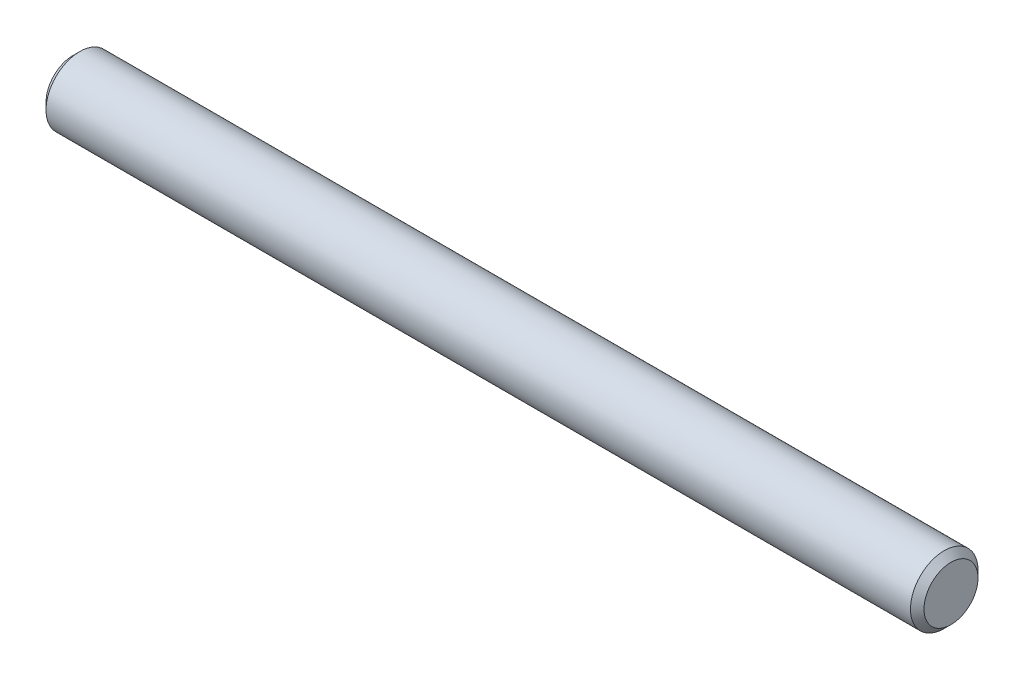
ISO-10303-21;
HEADER;
FILE_DESCRIPTION(('STEP AP214'),'2;1');
FILE_NAME('part.step','',(''),(''),'','','');
FILE_SCHEMA(('AUTOMOTIVE_DESIGN { 1 0 10303 214 1 1 1 1 }'));
ENDSEC;
DATA;
#1=APPLICATION_CONTEXT('core data for automotive mechanical design processes');
#2=APPLICATION_PROTOCOL_DEFINITION('international standard','automotive_design',2000,#1);
#3=PRODUCT_CONTEXT('',#1,'mechanical');
#4=PRODUCT('Part','Part','',(#3));
#5=PRODUCT_RELATED_PRODUCT_CATEGORY('part','',(#4));
#6=PRODUCT_DEFINITION_FORMATION('','',#4);
#7=PRODUCT_DEFINITION_CONTEXT('part definition',#1,'design');
#8=PRODUCT_DEFINITION('design','',#6,#7);
#9=PRODUCT_DEFINITION_SHAPE('','',#8);
#10=(LENGTH_UNIT() NAMED_UNIT(*) SI_UNIT(.MILLI.,.METRE.));
#11=(NAMED_UNIT(*) PLANE_ANGLE_UNIT() SI_UNIT($,.RADIAN.));
#12=(NAMED_UNIT(*) SI_UNIT($,.STERADIAN.) SOLID_ANGLE_UNIT());
#13=UNCERTAINTY_MEASURE_WITH_UNIT(LENGTH_MEASURE(1.E-05),#10,'distance_accuracy_value','');
#14=(GEOMETRIC_REPRESENTATION_CONTEXT(3) GLOBAL_UNCERTAINTY_ASSIGNED_CONTEXT((#13)) GLOBAL_UNIT_ASSIGNED_CONTEXT((#10,
#11,#12)) REPRESENTATION_CONTEXT('',''));
#15=CARTESIAN_POINT('',(0.,0.,0.));
#16=DIRECTION('',(0.,0.,1.));
#17=DIRECTION('',(1.,0.,0.));
#18=AXIS2_PLACEMENT_3D('',#15,#16,#17);
#19=CARTESIAN_POINT('',(-20.6375,0.,0.));
#20=DIRECTION('',(1.,0.,0.));
#21=DIRECTION('',(0.,0.,-1.));
#22=AXIS2_PLACEMENT_3D('',#19,#20,#21);
#23=CYLINDRICAL_SURFACE('',#22,1.5875);
#24=CARTESIAN_POINT('',(20.32,0.,0.));
#25=DIRECTION('',(1.,0.,0.));
#26=DIRECTION('',(0.,0.,-1.));
#27=AXIS2_PLACEMENT_3D('',#24,#25,#26);
#28=CIRCLE('',#27,1.5875);
#29=CARTESIAN_POINT('',(20.32,0.,-1.5875));
#30=VERTEX_POINT('',#29);
#31=EDGE_CURVE('E37',#30,#30,#28,.F.);
#32=ORIENTED_EDGE('',*,*,#31,.T.);
#33=EDGE_LOOP('',(#32));
#34=FACE_BOUND('',#33,.T.);
#35=CARTESIAN_POINT('',(-20.32,0.,0.));
#36=DIRECTION('',(1.,0.,0.));
#37=DIRECTION('',(0.,0.,-1.));
#38=AXIS2_PLACEMENT_3D('',#35,#36,#37);
#39=CIRCLE('',#38,1.5875);
#40=CARTESIAN_POINT('',(-20.32,0.,-1.5875));
#41=VERTEX_POINT('',#40);
#42=EDGE_CURVE('E41',#41,#41,#39,.T.);
#43=ORIENTED_EDGE('',*,*,#42,.T.);
#44=EDGE_LOOP('',(#43));
#45=FACE_BOUND('',#44,.T.);
#46=ADVANCED_FACE('F30',(#34,#45),#23,.T.);
#47=CARTESIAN_POINT('',(-20.6375,0.,0.));
#48=DIRECTION('',(1.,0.,0.));
#49=DIRECTION('',(0.,0.,-1.));
#50=AXIS2_PLACEMENT_3D('',#47,#48,#49);
#51=PLANE('',#50);
#52=CARTESIAN_POINT('',(-20.6375,0.,0.));
#53=DIRECTION('',(1.,0.,0.));
#54=DIRECTION('',(0.,0.,-1.));
#55=AXIS2_PLACEMENT_3D('',#52,#53,#54);
#56=CIRCLE('',#55,1.27);
#57=CARTESIAN_POINT('',(-20.6375,0.,-1.27));
#58=VERTEX_POINT('',#57);
#59=EDGE_CURVE('E10',#58,#58,#56,.F.);
#60=ORIENTED_EDGE('',*,*,#59,.T.);
#61=EDGE_LOOP('',(#60));
#62=FACE_BOUND('',#61,.T.);
#63=ADVANCED_FACE('F61',(#62),#51,.F.);
#64=CARTESIAN_POINT('',(20.6375,0.,0.));
#65=DIRECTION('',(1.,0.,0.));
#66=DIRECTION('',(0.,0.,-1.));
#67=AXIS2_PLACEMENT_3D('',#64,#65,#66);
#68=PLANE('',#67);
#69=CARTESIAN_POINT('',(20.6375,0.,0.));
#70=DIRECTION('',(1.,0.,0.));
#71=DIRECTION('',(0.,0.,-1.));
#72=AXIS2_PLACEMENT_3D('',#69,#70,#71);
#73=CIRCLE('',#72,1.27);
#74=CARTESIAN_POINT('',(20.6375,0.,-1.27));
#75=VERTEX_POINT('',#74);
#76=EDGE_CURVE('E45',#75,#75,#73,.T.);
#77=ORIENTED_EDGE('',*,*,#76,.T.);
#78=EDGE_LOOP('',(#77));
#79=FACE_BOUND('',#78,.T.);
#80=ADVANCED_FACE('F51',(#79),#68,.T.);
#81=CARTESIAN_POINT('',(20.6375,0.,0.));
#82=DIRECTION('',(-1.,0.,0.));
#83=DIRECTION('',(0.,0.,1.));
#84=AXIS2_PLACEMENT_3D('',#81,#82,#83);
#85=CONICAL_SURFACE('',#84,1.27,0.785398163397439);
#86=ORIENTED_EDGE('',*,*,#31,.F.);
#87=EDGE_LOOP('',(#86));
#88=FACE_BOUND('',#87,.T.);
#89=ORIENTED_EDGE('',*,*,#76,.F.);
#90=EDGE_LOOP('',(#89));
#91=FACE_BOUND('',#90,.T.);
#92=ADVANCED_FACE('F53',(#88,#91),#85,.T.);
#93=CARTESIAN_POINT('',(-20.32,0.,0.));
#94=DIRECTION('',(1.,0.,0.));
#95=DIRECTION('',(0.,0.,-1.));
#96=AXIS2_PLACEMENT_3D('',#93,#94,#95);
#97=CONICAL_SURFACE('',#96,1.5875,0.785398163397445);
#98=ORIENTED_EDGE('',*,*,#59,.F.);
#99=EDGE_LOOP('',(#98));
#100=FACE_BOUND('',#99,.T.);
#101=ORIENTED_EDGE('',*,*,#42,.F.);
#102=EDGE_LOOP('',(#101));
#103=FACE_BOUND('',#102,.T.);
#104=ADVANCED_FACE('F32',(#100,#103),#97,.T.);
#105=CLOSED_SHELL('',(#46,#63,#80,#92,#104));
#106=MANIFOLD_SOLID_BREP('B2',#105);
#107=ADVANCED_BREP_SHAPE_REPRESENTATION('',(#18,#106),#14);
#108=SHAPE_DEFINITION_REPRESENTATION(#9,#107);
ENDSEC;
END-ISO-10303-21;
